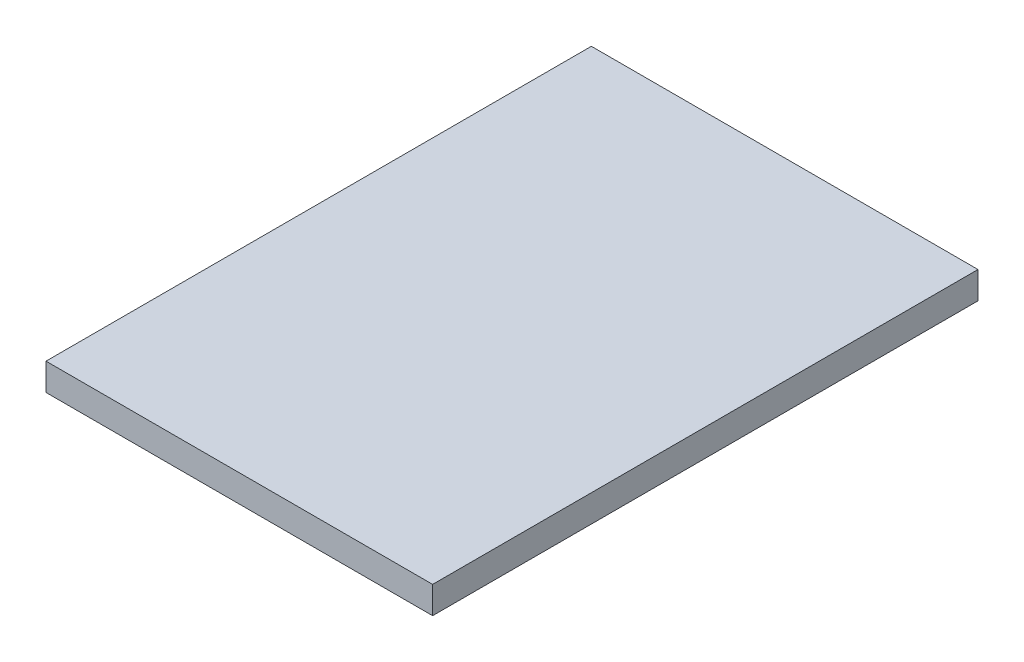
ISO-10303-21;
HEADER;
FILE_DESCRIPTION(('STEP AP214'),'2;1');
FILE_NAME('part.step','',(''),(''),'','','');
FILE_SCHEMA(('AUTOMOTIVE_DESIGN { 1 0 10303 214 1 1 1 1 }'));
ENDSEC;
DATA;
#1=APPLICATION_CONTEXT('core data for automotive mechanical design processes');
#2=APPLICATION_PROTOCOL_DEFINITION('international standard','automotive_design',2000,#1);
#3=PRODUCT_CONTEXT('',#1,'mechanical');
#4=PRODUCT('Part','Part','',(#3));
#5=PRODUCT_RELATED_PRODUCT_CATEGORY('part','',(#4));
#6=PRODUCT_DEFINITION_FORMATION('','',#4);
#7=PRODUCT_DEFINITION_CONTEXT('part definition',#1,'design');
#8=PRODUCT_DEFINITION('design','',#6,#7);
#9=PRODUCT_DEFINITION_SHAPE('','',#8);
#10=(LENGTH_UNIT() NAMED_UNIT(*) SI_UNIT(.MILLI.,.METRE.));
#11=(NAMED_UNIT(*) PLANE_ANGLE_UNIT() SI_UNIT($,.RADIAN.));
#12=(NAMED_UNIT(*) SI_UNIT($,.STERADIAN.) SOLID_ANGLE_UNIT());
#13=UNCERTAINTY_MEASURE_WITH_UNIT(LENGTH_MEASURE(1.E-05),#10,'distance_accuracy_value','');
#14=(GEOMETRIC_REPRESENTATION_CONTEXT(3) GLOBAL_UNCERTAINTY_ASSIGNED_CONTEXT((#13)) GLOBAL_UNIT_ASSIGNED_CONTEXT((#10,
#11,#12)) REPRESENTATION_CONTEXT('',''));
#15=CARTESIAN_POINT('',(0.,0.,0.));
#16=DIRECTION('',(0.,0.,1.));
#17=DIRECTION('',(1.,0.,0.));
#18=AXIS2_PLACEMENT_3D('',#15,#16,#17);
#19=CARTESIAN_POINT('',(0.,3.,0.));
#20=DIRECTION('',(1.,0.,0.));
#21=DIRECTION('',(0.,0.,-1.));
#22=AXIS2_PLACEMENT_3D('',#19,#20,#21);
#23=PLANE('',#22);
#24=DIRECTION('',(0.,0.,1.));
#25=VECTOR('',#24,1.);
#26=CARTESIAN_POINT('',(0.,0.,0.));
#27=LINE('',#26,#25);
#28=CARTESIAN_POINT('',(0.,0.,-60.26));
#29=VERTEX_POINT('',#28);
#30=CARTESIAN_POINT('',(0.,0.,0.));
#31=VERTEX_POINT('',#30);
#32=EDGE_CURVE('E96',#29,#31,#27,.T.);
#33=ORIENTED_EDGE('',*,*,#32,.T.);
#34=DIRECTION('',(0.,-1.,0.));
#35=VECTOR('',#34,1.);
#36=CARTESIAN_POINT('',(0.,3.,0.));
#37=LINE('',#36,#35);
#38=CARTESIAN_POINT('',(0.,3.,0.));
#39=VERTEX_POINT('',#38);
#40=EDGE_CURVE('E11',#39,#31,#37,.T.);
#41=ORIENTED_EDGE('',*,*,#40,.F.);
#42=DIRECTION('',(0.,0.,1.));
#43=VECTOR('',#42,1.);
#44=CARTESIAN_POINT('',(0.,3.,0.));
#45=LINE('',#44,#43);
#46=CARTESIAN_POINT('',(0.,3.,-60.26));
#47=VERTEX_POINT('',#46);
#48=EDGE_CURVE('E84',#47,#39,#45,.T.);
#49=ORIENTED_EDGE('',*,*,#48,.F.);
#50=DIRECTION('',(0.,-1.,0.));
#51=VECTOR('',#50,1.);
#52=CARTESIAN_POINT('',(0.,3.,-60.26));
#53=LINE('',#52,#51);
#54=EDGE_CURVE('E92',#47,#29,#53,.T.);
#55=ORIENTED_EDGE('',*,*,#54,.T.);
#56=EDGE_LOOP('',(#33,#41,#49,#55));
#57=FACE_BOUND('',#56,.T.);
#58=ADVANCED_FACE('F33',(#57),#23,.F.);
#59=CARTESIAN_POINT('',(0.,3.,0.));
#60=DIRECTION('',(0.,0.,-1.));
#61=DIRECTION('',(-1.,0.,0.));
#62=AXIS2_PLACEMENT_3D('',#59,#60,#61);
#63=PLANE('',#62);
#64=DIRECTION('',(1.,0.,0.));
#65=VECTOR('',#64,1.);
#66=CARTESIAN_POINT('',(0.,0.,0.));
#67=LINE('',#66,#65);
#68=CARTESIAN_POINT('',(42.72,0.,0.));
#69=VERTEX_POINT('',#68);
#70=EDGE_CURVE('E88',#31,#69,#67,.T.);
#71=ORIENTED_EDGE('',*,*,#70,.T.);
#72=DIRECTION('',(0.,-1.,0.));
#73=VECTOR('',#72,1.);
#74=CARTESIAN_POINT('',(42.72,3.,0.));
#75=LINE('',#74,#73);
#76=CARTESIAN_POINT('',(42.72,3.,0.));
#77=VERTEX_POINT('',#76);
#78=EDGE_CURVE('E41',#77,#69,#75,.T.);
#79=ORIENTED_EDGE('',*,*,#78,.F.);
#80=DIRECTION('',(1.,0.,0.));
#81=VECTOR('',#80,1.);
#82=CARTESIAN_POINT('',(0.,3.,0.));
#83=LINE('',#82,#81);
#84=EDGE_CURVE('E79',#39,#77,#83,.T.);
#85=ORIENTED_EDGE('',*,*,#84,.F.);
#86=ORIENTED_EDGE('',*,*,#40,.T.);
#87=EDGE_LOOP('',(#71,#79,#85,#86));
#88=FACE_BOUND('',#87,.T.);
#89=ADVANCED_FACE('F87',(#88),#63,.F.);
#90=CARTESIAN_POINT('',(42.72,3.,0.));
#91=DIRECTION('',(-1.,0.,0.));
#92=DIRECTION('',(0.,0.,1.));
#93=AXIS2_PLACEMENT_3D('',#90,#91,#92);
#94=PLANE('',#93);
#95=DIRECTION('',(0.,0.,-1.));
#96=VECTOR('',#95,1.);
#97=CARTESIAN_POINT('',(42.72,0.,0.));
#98=LINE('',#97,#96);
#99=CARTESIAN_POINT('',(42.72,0.,-60.26));
#100=VERTEX_POINT('',#99);
#101=EDGE_CURVE('E66',#69,#100,#98,.T.);
#102=ORIENTED_EDGE('',*,*,#101,.T.);
#103=DIRECTION('',(0.,-1.,0.));
#104=VECTOR('',#103,1.);
#105=CARTESIAN_POINT('',(42.72,3.,-60.26));
#106=LINE('',#105,#104);
#107=CARTESIAN_POINT('',(42.72,3.,-60.26));
#108=VERTEX_POINT('',#107);
#109=EDGE_CURVE('E89',#108,#100,#106,.T.);
#110=ORIENTED_EDGE('',*,*,#109,.F.);
#111=DIRECTION('',(0.,0.,-1.));
#112=VECTOR('',#111,1.);
#113=CARTESIAN_POINT('',(42.72,3.,0.));
#114=LINE('',#113,#112);
#115=EDGE_CURVE('E82',#77,#108,#114,.T.);
#116=ORIENTED_EDGE('',*,*,#115,.F.);
#117=ORIENTED_EDGE('',*,*,#78,.T.);
#118=EDGE_LOOP('',(#102,#110,#116,#117));
#119=FACE_BOUND('',#118,.T.);
#120=ADVANCED_FACE('F90',(#119),#94,.F.);
#121=CARTESIAN_POINT('',(0.,3.,-60.26));
#122=DIRECTION('',(0.,0.,1.));
#123=DIRECTION('',(1.,0.,0.));
#124=AXIS2_PLACEMENT_3D('',#121,#122,#123);
#125=PLANE('',#124);
#126=DIRECTION('',(-1.,0.,0.));
#127=VECTOR('',#126,1.);
#128=CARTESIAN_POINT('',(0.,0.,-60.26));
#129=LINE('',#128,#127);
#130=EDGE_CURVE('E72',#100,#29,#129,.T.);
#131=ORIENTED_EDGE('',*,*,#130,.T.);
#132=ORIENTED_EDGE('',*,*,#54,.F.);
#133=DIRECTION('',(-1.,0.,0.));
#134=VECTOR('',#133,1.);
#135=CARTESIAN_POINT('',(0.,3.,-60.26));
#136=LINE('',#135,#134);
#137=EDGE_CURVE('E49',#108,#47,#136,.T.);
#138=ORIENTED_EDGE('',*,*,#137,.F.);
#139=ORIENTED_EDGE('',*,*,#109,.T.);
#140=EDGE_LOOP('',(#131,#132,#138,#139));
#141=FACE_BOUND('',#140,.T.);
#142=ADVANCED_FACE('F103',(#141),#125,.F.);
#143=CARTESIAN_POINT('',(0.,3.,0.));
#144=DIRECTION('',(0.,-1.,0.));
#145=DIRECTION('',(0.,0.,-1.));
#146=AXIS2_PLACEMENT_3D('',#143,#144,#145);
#147=PLANE('',#146);
#148=ORIENTED_EDGE('',*,*,#48,.T.);
#149=ORIENTED_EDGE('',*,*,#84,.T.);
#150=ORIENTED_EDGE('',*,*,#115,.T.);
#151=ORIENTED_EDGE('',*,*,#137,.T.);
#152=EDGE_LOOP('',(#148,#149,#150,#151));
#153=FACE_BOUND('',#152,.T.);
#154=ADVANCED_FACE('F80',(#153),#147,.F.);
#155=CARTESIAN_POINT('',(0.,0.,0.));
#156=DIRECTION('',(0.,-1.,0.));
#157=DIRECTION('',(0.,0.,-1.));
#158=AXIS2_PLACEMENT_3D('',#155,#156,#157);
#159=PLANE('',#158);
#160=ORIENTED_EDGE('',*,*,#32,.F.);
#161=ORIENTED_EDGE('',*,*,#130,.F.);
#162=ORIENTED_EDGE('',*,*,#101,.F.);
#163=ORIENTED_EDGE('',*,*,#70,.F.);
#164=EDGE_LOOP('',(#160,#161,#162,#163));
#165=FACE_BOUND('',#164,.T.);
#166=ADVANCED_FACE('F106',(#165),#159,.T.);
#167=CLOSED_SHELL('',(#58,#89,#120,#142,#154,#166));
#168=MANIFOLD_SOLID_BREP('B2',#167);
#169=ADVANCED_BREP_SHAPE_REPRESENTATION('',(#18,#168),#14);
#170=SHAPE_DEFINITION_REPRESENTATION(#9,#169);
ENDSEC;
END-ISO-10303-21;
